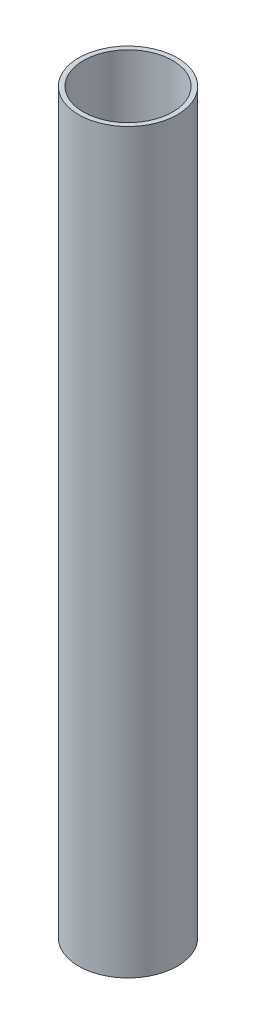
ISO-10303-21;
HEADER;
FILE_DESCRIPTION(('STEP AP214'),'2;1');
FILE_NAME('part.step','',(''),(''),'','','');
FILE_SCHEMA(('AUTOMOTIVE_DESIGN { 1 0 10303 214 1 1 1 1 }'));
ENDSEC;
DATA;
#1=APPLICATION_CONTEXT('core data for automotive mechanical design processes');
#2=APPLICATION_PROTOCOL_DEFINITION('international standard','automotive_design',2000,#1);
#3=PRODUCT_CONTEXT('',#1,'mechanical');
#4=PRODUCT('Part','Part','',(#3));
#5=PRODUCT_RELATED_PRODUCT_CATEGORY('part','',(#4));
#6=PRODUCT_DEFINITION_FORMATION('','',#4);
#7=PRODUCT_DEFINITION_CONTEXT('part definition',#1,'design');
#8=PRODUCT_DEFINITION('design','',#6,#7);
#9=PRODUCT_DEFINITION_SHAPE('','',#8);
#10=(LENGTH_UNIT() NAMED_UNIT(*) SI_UNIT(.MILLI.,.METRE.));
#11=(NAMED_UNIT(*) PLANE_ANGLE_UNIT() SI_UNIT($,.RADIAN.));
#12=(NAMED_UNIT(*) SI_UNIT($,.STERADIAN.) SOLID_ANGLE_UNIT());
#13=UNCERTAINTY_MEASURE_WITH_UNIT(LENGTH_MEASURE(1.E-05),#10,'distance_accuracy_value','');
#14=(GEOMETRIC_REPRESENTATION_CONTEXT(3) GLOBAL_UNCERTAINTY_ASSIGNED_CONTEXT((#13)) GLOBAL_UNIT_ASSIGNED_CONTEXT((#10,
#11,#12)) REPRESENTATION_CONTEXT('',''));
#15=CARTESIAN_POINT('',(0.,0.,0.));
#16=DIRECTION('',(0.,0.,1.));
#17=DIRECTION('',(1.,0.,0.));
#18=AXIS2_PLACEMENT_3D('',#15,#16,#17);
#19=CARTESIAN_POINT('',(0.,314.,0.));
#20=DIRECTION('',(0.,1.,0.));
#21=DIRECTION('',(0.,0.,1.));
#22=AXIS2_PLACEMENT_3D('',#19,#20,#21);
#23=PLANE('',#22);
#24=CARTESIAN_POINT('',(0.,314.,0.));
#25=DIRECTION('',(0.,1.,0.));
#26=DIRECTION('',(1.,0.,0.));
#27=AXIS2_PLACEMENT_3D('',#24,#25,#26);
#28=CIRCLE('',#27,21.);
#29=CARTESIAN_POINT('',(21.,314.,0.));
#30=VERTEX_POINT('',#29);
#31=EDGE_CURVE('E11',#30,#30,#28,.T.);
#32=ORIENTED_EDGE('',*,*,#31,.T.);
#33=EDGE_LOOP('',(#32));
#34=FACE_BOUND('',#33,.T.);
#35=CARTESIAN_POINT('',(0.,314.,0.));
#36=DIRECTION('',(0.,1.,0.));
#37=DIRECTION('',(0.,0.,1.));
#38=AXIS2_PLACEMENT_3D('',#35,#36,#37);
#39=CIRCLE('',#38,19.);
#40=CARTESIAN_POINT('',(0.,314.,19.));
#41=VERTEX_POINT('',#40);
#42=EDGE_CURVE('E58',#41,#41,#39,.T.);
#43=ORIENTED_EDGE('',*,*,#42,.F.);
#44=EDGE_LOOP('',(#43));
#45=FACE_BOUND('',#44,.T.);
#46=ADVANCED_FACE('F45',(#34,#45),#23,.T.);
#47=CARTESIAN_POINT('',(0.,0.,0.));
#48=DIRECTION('',(0.,1.,0.));
#49=DIRECTION('',(0.,0.,1.));
#50=AXIS2_PLACEMENT_3D('',#47,#48,#49);
#51=PLANE('',#50);
#52=CARTESIAN_POINT('',(0.,0.,0.));
#53=DIRECTION('',(0.,1.,0.));
#54=DIRECTION('',(1.,0.,0.));
#55=AXIS2_PLACEMENT_3D('',#52,#53,#54);
#56=CIRCLE('',#55,21.);
#57=CARTESIAN_POINT('',(21.,0.,0.));
#58=VERTEX_POINT('',#57);
#59=EDGE_CURVE('E49',#58,#58,#56,.T.);
#60=ORIENTED_EDGE('',*,*,#59,.F.);
#61=EDGE_LOOP('',(#60));
#62=FACE_BOUND('',#61,.T.);
#63=CARTESIAN_POINT('',(0.,0.,0.));
#64=DIRECTION('',(0.,1.,0.));
#65=DIRECTION('',(0.,0.,1.));
#66=AXIS2_PLACEMENT_3D('',#63,#64,#65);
#67=CIRCLE('',#66,19.);
#68=CARTESIAN_POINT('',(0.,0.,19.));
#69=VERTEX_POINT('',#68);
#70=EDGE_CURVE('E60',#69,#69,#67,.T.);
#71=ORIENTED_EDGE('',*,*,#70,.T.);
#72=EDGE_LOOP('',(#71));
#73=FACE_BOUND('',#72,.T.);
#74=ADVANCED_FACE('F72',(#62,#73),#51,.F.);
#75=CARTESIAN_POINT('',(0.,314.,0.));
#76=DIRECTION('',(0.,-1.,0.));
#77=DIRECTION('',(0.,0.,-1.));
#78=AXIS2_PLACEMENT_3D('',#75,#76,#77);
#79=CYLINDRICAL_SURFACE('',#78,21.);
#80=ORIENTED_EDGE('',*,*,#31,.F.);
#81=EDGE_LOOP('',(#80));
#82=FACE_BOUND('',#81,.T.);
#83=ORIENTED_EDGE('',*,*,#59,.T.);
#84=EDGE_LOOP('',(#83));
#85=FACE_BOUND('',#84,.T.);
#86=ADVANCED_FACE('F47',(#82,#85),#79,.T.);
#87=CARTESIAN_POINT('',(0.,314.,0.));
#88=DIRECTION('',(0.,-1.,0.));
#89=DIRECTION('',(0.,0.,-1.));
#90=AXIS2_PLACEMENT_3D('',#87,#88,#89);
#91=CYLINDRICAL_SURFACE('',#90,19.);
#92=ORIENTED_EDGE('',*,*,#42,.T.);
#93=EDGE_LOOP('',(#92));
#94=FACE_BOUND('',#93,.T.);
#95=ORIENTED_EDGE('',*,*,#70,.F.);
#96=EDGE_LOOP('',(#95));
#97=FACE_BOUND('',#96,.T.);
#98=ADVANCED_FACE('F68',(#94,#97),#91,.F.);
#99=CLOSED_SHELL('',(#46,#74,#86,#98));
#100=MANIFOLD_SOLID_BREP('B2',#99);
#101=ADVANCED_BREP_SHAPE_REPRESENTATION('',(#18,#100),#14);
#102=SHAPE_DEFINITION_REPRESENTATION(#9,#101);
ENDSEC;
END-ISO-10303-21;
